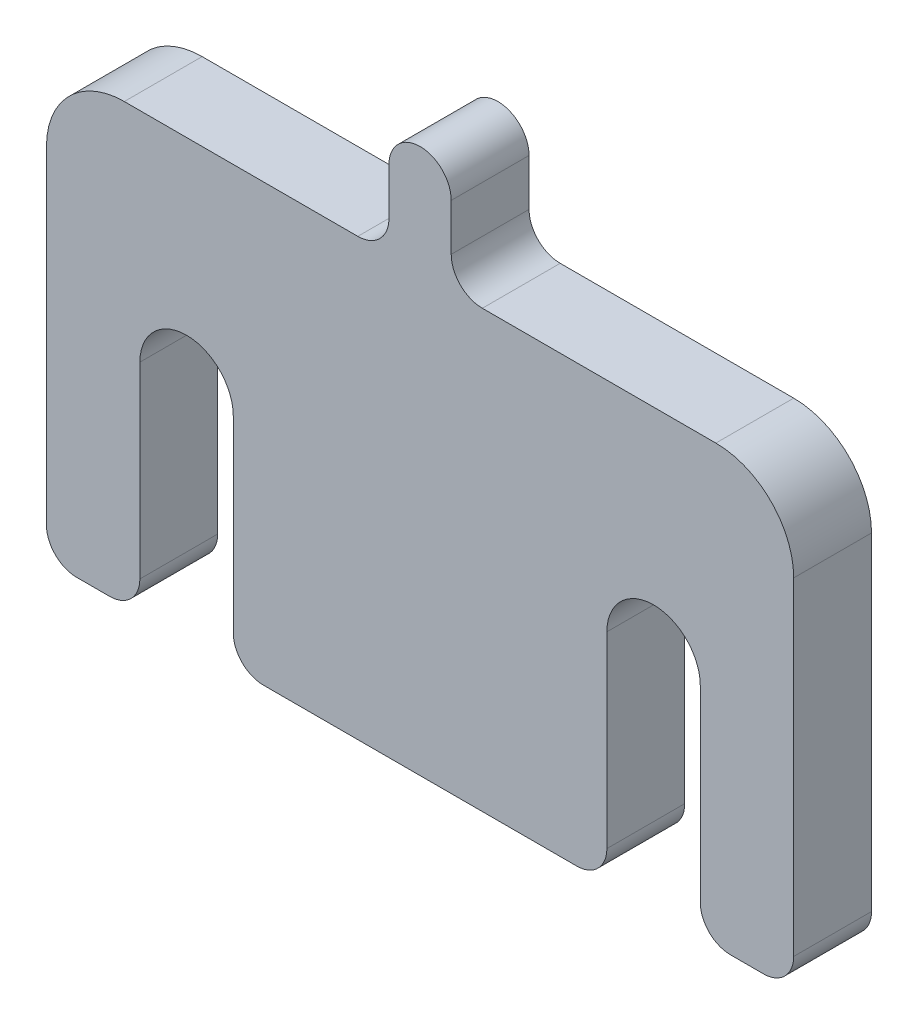
ISO-10303-21;
HEADER;
FILE_DESCRIPTION(('STEP AP214'),'2;1');
FILE_NAME('part.step','',(''),(''),'','','');
FILE_SCHEMA(('AUTOMOTIVE_DESIGN { 1 0 10303 214 1 1 1 1 }'));
ENDSEC;
DATA;
#1=APPLICATION_CONTEXT('core data for automotive mechanical design processes');
#2=APPLICATION_PROTOCOL_DEFINITION('international standard','automotive_design',2000,#1);
#3=PRODUCT_CONTEXT('',#1,'mechanical');
#4=PRODUCT('Part','Part','',(#3));
#5=PRODUCT_RELATED_PRODUCT_CATEGORY('part','',(#4));
#6=PRODUCT_DEFINITION_FORMATION('','',#4);
#7=PRODUCT_DEFINITION_CONTEXT('part definition',#1,'design');
#8=PRODUCT_DEFINITION('design','',#6,#7);
#9=PRODUCT_DEFINITION_SHAPE('','',#8);
#10=(LENGTH_UNIT() NAMED_UNIT(*) SI_UNIT(.MILLI.,.METRE.));
#11=(NAMED_UNIT(*) PLANE_ANGLE_UNIT() SI_UNIT($,.RADIAN.));
#12=(NAMED_UNIT(*) SI_UNIT($,.STERADIAN.) SOLID_ANGLE_UNIT());
#13=UNCERTAINTY_MEASURE_WITH_UNIT(LENGTH_MEASURE(1.E-05),#10,'distance_accuracy_value','');
#14=(GEOMETRIC_REPRESENTATION_CONTEXT(3) GLOBAL_UNCERTAINTY_ASSIGNED_CONTEXT((#13)) GLOBAL_UNIT_ASSIGNED_CONTEXT((#10,
#11,#12)) REPRESENTATION_CONTEXT('',''));
#15=CARTESIAN_POINT('',(0.,0.,0.));
#16=DIRECTION('',(0.,0.,1.));
#17=DIRECTION('',(1.,0.,0.));
#18=AXIS2_PLACEMENT_3D('',#15,#16,#17);
#19=CARTESIAN_POINT('',(0.,14.,-5.));
#20=DIRECTION('',(0.,-1.,0.));
#21=DIRECTION('',(1.,0.,0.));
#22=AXIS2_PLACEMENT_3D('',#19,#20,#21);
#23=PLANE('',#22);
#24=DIRECTION('',(-1.,0.,0.));
#25=VECTOR('',#24,1.);
#26=CARTESIAN_POINT('',(0.,14.,0.));
#27=LINE('',#26,#25);
#28=CARTESIAN_POINT('',(19.,14.,0.));
#29=VERTEX_POINT('',#28);
#30=CARTESIAN_POINT('',(4.,14.,0.));
#31=VERTEX_POINT('',#30);
#32=EDGE_CURVE('E243',#29,#31,#27,.T.);
#33=ORIENTED_EDGE('',*,*,#32,.F.);
#34=DIRECTION('',(0.,0.,1.));
#35=VECTOR('',#34,1.);
#36=CARTESIAN_POINT('',(19.,14.,-5.));
#37=LINE('',#36,#35);
#38=CARTESIAN_POINT('',(19.,14.,-5.));
#39=VERTEX_POINT('',#38);
#40=EDGE_CURVE('E242',#39,#29,#37,.T.);
#41=ORIENTED_EDGE('',*,*,#40,.F.);
#42=DIRECTION('',(-1.,0.,0.));
#43=VECTOR('',#42,1.);
#44=CARTESIAN_POINT('',(0.,14.,-5.));
#45=LINE('',#44,#43);
#46=CARTESIAN_POINT('',(4.,14.,-5.));
#47=VERTEX_POINT('',#46);
#48=EDGE_CURVE('E304',#39,#47,#45,.T.);
#49=ORIENTED_EDGE('',*,*,#48,.T.);
#50=DIRECTION('',(0.,0.,1.));
#51=VECTOR('',#50,1.);
#52=CARTESIAN_POINT('',(4.,14.,-5.));
#53=LINE('',#52,#51);
#54=EDGE_CURVE('E11',#47,#31,#53,.T.);
#55=ORIENTED_EDGE('',*,*,#54,.T.);
#56=EDGE_LOOP('',(#33,#41,#49,#55));
#57=FACE_BOUND('',#56,.T.);
#58=ADVANCED_FACE('F39',(#57),#23,.F.);
#59=CARTESIAN_POINT('',(4.,16.,-5.));
#60=DIRECTION('',(0.,0.,1.));
#61=DIRECTION('',(-1.,0.,0.));
#62=AXIS2_PLACEMENT_3D('',#59,#60,#61);
#63=CYLINDRICAL_SURFACE('',#62,2.);
#64=CARTESIAN_POINT('',(4.,16.,0.));
#65=DIRECTION('',(0.,0.,1.));
#66=DIRECTION('',(1.,0.,0.));
#67=AXIS2_PLACEMENT_3D('',#64,#65,#66);
#68=CIRCLE('',#67,2.);
#69=CARTESIAN_POINT('',(2.,16.,0.));
#70=VERTEX_POINT('',#69);
#71=EDGE_CURVE('E245',#31,#70,#68,.F.);
#72=ORIENTED_EDGE('',*,*,#71,.F.);
#73=ORIENTED_EDGE('',*,*,#54,.F.);
#74=CARTESIAN_POINT('',(4.,16.,-5.));
#75=DIRECTION('',(0.,0.,1.));
#76=DIRECTION('',(1.,0.,0.));
#77=AXIS2_PLACEMENT_3D('',#74,#75,#76);
#78=CIRCLE('',#77,2.);
#79=CARTESIAN_POINT('',(2.,16.,-5.));
#80=VERTEX_POINT('',#79);
#81=EDGE_CURVE('E147',#47,#80,#78,.F.);
#82=ORIENTED_EDGE('',*,*,#81,.T.);
#83=DIRECTION('',(0.,0.,1.));
#84=VECTOR('',#83,1.);
#85=CARTESIAN_POINT('',(2.,16.,-5.));
#86=LINE('',#85,#84);
#87=EDGE_CURVE('E47',#80,#70,#86,.T.);
#88=ORIENTED_EDGE('',*,*,#87,.T.);
#89=EDGE_LOOP('',(#72,#73,#82,#88));
#90=FACE_BOUND('',#89,.T.);
#91=ADVANCED_FACE('F370',(#90),#63,.F.);
#92=CARTESIAN_POINT('',(1.99999999999999,0.,-5.));
#93=DIRECTION('',(1.,0.,0.));
#94=DIRECTION('',(0.,1.,0.));
#95=AXIS2_PLACEMENT_3D('',#92,#93,#94);
#96=PLANE('',#95);
#97=DIRECTION('',(0.,-1.,0.));
#98=VECTOR('',#97,1.);
#99=CARTESIAN_POINT('',(1.99999999999999,0.,0.));
#100=LINE('',#99,#98);
#101=CARTESIAN_POINT('',(2.,19.,0.));
#102=VERTEX_POINT('',#101);
#103=EDGE_CURVE('E248',#102,#70,#100,.T.);
#104=ORIENTED_EDGE('',*,*,#103,.T.);
#105=ORIENTED_EDGE('',*,*,#87,.F.);
#106=DIRECTION('',(0.,-1.,0.));
#107=VECTOR('',#106,1.);
#108=CARTESIAN_POINT('',(1.99999999999999,0.,-5.));
#109=LINE('',#108,#107);
#110=CARTESIAN_POINT('',(2.,19.,-5.));
#111=VERTEX_POINT('',#110);
#112=EDGE_CURVE('E380',#111,#80,#109,.T.);
#113=ORIENTED_EDGE('',*,*,#112,.F.);
#114=DIRECTION('',(0.,0.,1.));
#115=VECTOR('',#114,1.);
#116=CARTESIAN_POINT('',(2.,19.,-5.));
#117=LINE('',#116,#115);
#118=EDGE_CURVE('E365',#111,#102,#117,.T.);
#119=ORIENTED_EDGE('',*,*,#118,.T.);
#120=EDGE_LOOP('',(#104,#105,#113,#119));
#121=FACE_BOUND('',#120,.T.);
#122=ADVANCED_FACE('F508',(#121),#96,.T.);
#123=CARTESIAN_POINT('',(0.,19.,-5.));
#124=DIRECTION('',(0.,0.,1.));
#125=DIRECTION('',(-1.,0.,0.));
#126=AXIS2_PLACEMENT_3D('',#123,#124,#125);
#127=CYLINDRICAL_SURFACE('',#126,2.);
#128=CARTESIAN_POINT('',(0.,19.,0.));
#129=DIRECTION('',(0.,0.,1.));
#130=DIRECTION('',(1.,0.,0.));
#131=AXIS2_PLACEMENT_3D('',#128,#129,#130);
#132=CIRCLE('',#131,2.);
#133=CARTESIAN_POINT('',(-2.,19.,0.));
#134=VERTEX_POINT('',#133);
#135=EDGE_CURVE('E250',#102,#134,#132,.T.);
#136=ORIENTED_EDGE('',*,*,#135,.F.);
#137=ORIENTED_EDGE('',*,*,#118,.F.);
#138=CARTESIAN_POINT('',(0.,19.,-5.));
#139=DIRECTION('',(0.,0.,1.));
#140=DIRECTION('',(1.,0.,0.));
#141=AXIS2_PLACEMENT_3D('',#138,#139,#140);
#142=CIRCLE('',#141,2.);
#143=CARTESIAN_POINT('',(-2.,19.,-5.));
#144=VERTEX_POINT('',#143);
#145=EDGE_CURVE('E384',#111,#144,#142,.T.);
#146=ORIENTED_EDGE('',*,*,#145,.T.);
#147=DIRECTION('',(0.,0.,1.));
#148=VECTOR('',#147,1.);
#149=CARTESIAN_POINT('',(-2.,19.,-5.));
#150=LINE('',#149,#148);
#151=EDGE_CURVE('E362',#144,#134,#150,.T.);
#152=ORIENTED_EDGE('',*,*,#151,.T.);
#153=EDGE_LOOP('',(#136,#137,#146,#152));
#154=FACE_BOUND('',#153,.T.);
#155=ADVANCED_FACE('F507',(#154),#127,.T.);
#156=CARTESIAN_POINT('',(-1.99999999999999,0.,-5.));
#157=DIRECTION('',(1.,0.,0.));
#158=DIRECTION('',(0.,1.,0.));
#159=AXIS2_PLACEMENT_3D('',#156,#157,#158);
#160=PLANE('',#159);
#161=DIRECTION('',(0.,-1.,0.));
#162=VECTOR('',#161,1.);
#163=CARTESIAN_POINT('',(-1.99999999999999,0.,0.));
#164=LINE('',#163,#162);
#165=CARTESIAN_POINT('',(-2.,16.,0.));
#166=VERTEX_POINT('',#165);
#167=EDGE_CURVE('E253',#134,#166,#164,.T.);
#168=ORIENTED_EDGE('',*,*,#167,.F.);
#169=ORIENTED_EDGE('',*,*,#151,.F.);
#170=DIRECTION('',(0.,-1.,0.));
#171=VECTOR('',#170,1.);
#172=CARTESIAN_POINT('',(-1.99999999999999,0.,-5.));
#173=LINE('',#172,#171);
#174=CARTESIAN_POINT('',(-2.,16.,-5.));
#175=VERTEX_POINT('',#174);
#176=EDGE_CURVE('E387',#144,#175,#173,.T.);
#177=ORIENTED_EDGE('',*,*,#176,.T.);
#178=DIRECTION('',(0.,0.,1.));
#179=VECTOR('',#178,1.);
#180=CARTESIAN_POINT('',(-2.,16.,-5.));
#181=LINE('',#180,#179);
#182=EDGE_CURVE('E359',#175,#166,#181,.T.);
#183=ORIENTED_EDGE('',*,*,#182,.T.);
#184=EDGE_LOOP('',(#168,#169,#177,#183));
#185=FACE_BOUND('',#184,.T.);
#186=ADVANCED_FACE('F504',(#185),#160,.F.);
#187=CARTESIAN_POINT('',(-4.,16.,-5.));
#188=DIRECTION('',(0.,0.,1.));
#189=DIRECTION('',(-1.,0.,0.));
#190=AXIS2_PLACEMENT_3D('',#187,#188,#189);
#191=CYLINDRICAL_SURFACE('',#190,2.);
#192=CARTESIAN_POINT('',(-4.,16.,0.));
#193=DIRECTION('',(0.,0.,1.));
#194=DIRECTION('',(1.,0.,0.));
#195=AXIS2_PLACEMENT_3D('',#192,#193,#194);
#196=CIRCLE('',#195,2.);
#197=CARTESIAN_POINT('',(-4.,14.,0.));
#198=VERTEX_POINT('',#197);
#199=EDGE_CURVE('E256',#198,#166,#196,.T.);
#200=ORIENTED_EDGE('',*,*,#199,.T.);
#201=ORIENTED_EDGE('',*,*,#182,.F.);
#202=CARTESIAN_POINT('',(-4.,16.,-5.));
#203=DIRECTION('',(0.,0.,1.));
#204=DIRECTION('',(1.,0.,0.));
#205=AXIS2_PLACEMENT_3D('',#202,#203,#204);
#206=CIRCLE('',#205,2.);
#207=CARTESIAN_POINT('',(-4.,14.,-5.));
#208=VERTEX_POINT('',#207);
#209=EDGE_CURVE('E390',#208,#175,#206,.T.);
#210=ORIENTED_EDGE('',*,*,#209,.F.);
#211=DIRECTION('',(0.,0.,1.));
#212=VECTOR('',#211,1.);
#213=CARTESIAN_POINT('',(-4.,14.,-5.));
#214=LINE('',#213,#212);
#215=EDGE_CURVE('E356',#208,#198,#214,.T.);
#216=ORIENTED_EDGE('',*,*,#215,.T.);
#217=EDGE_LOOP('',(#200,#201,#210,#216));
#218=FACE_BOUND('',#217,.T.);
#219=ADVANCED_FACE('F501',(#218),#191,.F.);
#220=CARTESIAN_POINT('',(0.,14.,-5.));
#221=DIRECTION('',(0.,-1.,0.));
#222=DIRECTION('',(1.,0.,0.));
#223=AXIS2_PLACEMENT_3D('',#220,#221,#222);
#224=PLANE('',#223);
#225=DIRECTION('',(-1.,0.,0.));
#226=VECTOR('',#225,1.);
#227=CARTESIAN_POINT('',(0.,14.,0.));
#228=LINE('',#227,#226);
#229=CARTESIAN_POINT('',(-19.,14.,0.));
#230=VERTEX_POINT('',#229);
#231=EDGE_CURVE('E258',#198,#230,#228,.T.);
#232=ORIENTED_EDGE('',*,*,#231,.F.);
#233=ORIENTED_EDGE('',*,*,#215,.F.);
#234=DIRECTION('',(-1.,0.,0.));
#235=VECTOR('',#234,1.);
#236=CARTESIAN_POINT('',(0.,14.,-5.));
#237=LINE('',#236,#235);
#238=CARTESIAN_POINT('',(-19.,14.,-5.));
#239=VERTEX_POINT('',#238);
#240=EDGE_CURVE('E392',#208,#239,#237,.T.);
#241=ORIENTED_EDGE('',*,*,#240,.T.);
#242=DIRECTION('',(0.,0.,1.));
#243=VECTOR('',#242,1.);
#244=CARTESIAN_POINT('',(-19.,14.,-5.));
#245=LINE('',#244,#243);
#246=EDGE_CURVE('E353',#239,#230,#245,.T.);
#247=ORIENTED_EDGE('',*,*,#246,.T.);
#248=EDGE_LOOP('',(#232,#233,#241,#247));
#249=FACE_BOUND('',#248,.T.);
#250=ADVANCED_FACE('F498',(#249),#224,.F.);
#251=CARTESIAN_POINT('',(-19.,9.,-5.));
#252=DIRECTION('',(0.,0.,1.));
#253=DIRECTION('',(-1.,0.,0.));
#254=AXIS2_PLACEMENT_3D('',#251,#252,#253);
#255=CYLINDRICAL_SURFACE('',#254,5.);
#256=CARTESIAN_POINT('',(-19.,9.,0.));
#257=DIRECTION('',(0.,0.,1.));
#258=DIRECTION('',(1.,0.,0.));
#259=AXIS2_PLACEMENT_3D('',#256,#257,#258);
#260=CIRCLE('',#259,5.);
#261=CARTESIAN_POINT('',(-24.,9.,0.));
#262=VERTEX_POINT('',#261);
#263=EDGE_CURVE('E261',#262,#230,#260,.F.);
#264=ORIENTED_EDGE('',*,*,#263,.T.);
#265=ORIENTED_EDGE('',*,*,#246,.F.);
#266=CARTESIAN_POINT('',(-19.,9.,-5.));
#267=DIRECTION('',(0.,0.,1.));
#268=DIRECTION('',(1.,0.,0.));
#269=AXIS2_PLACEMENT_3D('',#266,#267,#268);
#270=CIRCLE('',#269,5.);
#271=CARTESIAN_POINT('',(-24.,9.,-5.));
#272=VERTEX_POINT('',#271);
#273=EDGE_CURVE('E395',#272,#239,#270,.F.);
#274=ORIENTED_EDGE('',*,*,#273,.F.);
#275=DIRECTION('',(0.,0.,1.));
#276=VECTOR('',#275,1.);
#277=CARTESIAN_POINT('',(-24.,9.,-5.));
#278=LINE('',#277,#276);
#279=EDGE_CURVE('E350',#272,#262,#278,.T.);
#280=ORIENTED_EDGE('',*,*,#279,.T.);
#281=EDGE_LOOP('',(#264,#265,#274,#280));
#282=FACE_BOUND('',#281,.T.);
#283=ADVANCED_FACE('F493',(#282),#255,.T.);
#284=CARTESIAN_POINT('',(-24.,0.,-5.));
#285=DIRECTION('',(-1.,0.,0.));
#286=DIRECTION('',(0.,0.,-1.));
#287=AXIS2_PLACEMENT_3D('',#284,#285,#286);
#288=PLANE('',#287);
#289=DIRECTION('',(0.,1.,0.));
#290=VECTOR('',#289,1.);
#291=CARTESIAN_POINT('',(-24.,0.,0.));
#292=LINE('',#291,#290);
#293=CARTESIAN_POINT('',(-24.,-12.0597401295921,0.));
#294=VERTEX_POINT('',#293);
#295=EDGE_CURVE('E263',#294,#262,#292,.T.);
#296=ORIENTED_EDGE('',*,*,#295,.T.);
#297=ORIENTED_EDGE('',*,*,#279,.F.);
#298=DIRECTION('',(0.,1.,0.));
#299=VECTOR('',#298,1.);
#300=CARTESIAN_POINT('',(-24.,0.,-5.));
#301=LINE('',#300,#299);
#302=CARTESIAN_POINT('',(-24.,-12.0597401295921,-5.));
#303=VERTEX_POINT('',#302);
#304=EDGE_CURVE('E397',#303,#272,#301,.T.);
#305=ORIENTED_EDGE('',*,*,#304,.F.);
#306=DIRECTION('',(0.,0.,1.));
#307=VECTOR('',#306,1.);
#308=CARTESIAN_POINT('',(-24.,-12.0597401295921,-5.));
#309=LINE('',#308,#307);
#310=EDGE_CURVE('E347',#303,#294,#309,.T.);
#311=ORIENTED_EDGE('',*,*,#310,.T.);
#312=EDGE_LOOP('',(#296,#297,#305,#311));
#313=FACE_BOUND('',#312,.T.);
#314=ADVANCED_FACE('F488',(#313),#288,.T.);
#315=CARTESIAN_POINT('',(-22.0597401295921,-12.0597401295921,-5.));
#316=DIRECTION('',(0.,0.,1.));
#317=DIRECTION('',(-1.,0.,0.));
#318=AXIS2_PLACEMENT_3D('',#315,#316,#317);
#319=CYLINDRICAL_SURFACE('',#318,1.94025987040791);
#320=CARTESIAN_POINT('',(-22.0597401295921,-12.0597401295921,0.));
#321=DIRECTION('',(0.,0.,1.));
#322=DIRECTION('',(1.,0.,0.));
#323=AXIS2_PLACEMENT_3D('',#320,#321,#322);
#324=CIRCLE('',#323,1.94025987040791);
#325=CARTESIAN_POINT('',(-22.0597401295921,-14.,0.));
#326=VERTEX_POINT('',#325);
#327=EDGE_CURVE('E265',#294,#326,#324,.T.);
#328=ORIENTED_EDGE('',*,*,#327,.F.);
#329=ORIENTED_EDGE('',*,*,#310,.F.);
#330=CARTESIAN_POINT('',(-22.0597401295921,-12.0597401295921,-5.));
#331=DIRECTION('',(0.,0.,1.));
#332=DIRECTION('',(1.,0.,0.));
#333=AXIS2_PLACEMENT_3D('',#330,#331,#332);
#334=CIRCLE('',#333,1.94025987040791);
#335=CARTESIAN_POINT('',(-22.0597401295921,-14.,-5.));
#336=VERTEX_POINT('',#335);
#337=EDGE_CURVE('E399',#303,#336,#334,.T.);
#338=ORIENTED_EDGE('',*,*,#337,.T.);
#339=DIRECTION('',(0.,0.,1.));
#340=VECTOR('',#339,1.);
#341=CARTESIAN_POINT('',(-22.0597401295921,-14.,-5.));
#342=LINE('',#341,#340);
#343=EDGE_CURVE('E344',#336,#326,#342,.T.);
#344=ORIENTED_EDGE('',*,*,#343,.T.);
#345=EDGE_LOOP('',(#328,#329,#338,#344));
#346=FACE_BOUND('',#345,.T.);
#347=ADVANCED_FACE('F485',(#346),#319,.T.);
#348=CARTESIAN_POINT('',(0.,-14.,-5.));
#349=DIRECTION('',(0.,-1.,0.));
#350=DIRECTION('',(0.,0.,1.));
#351=AXIS2_PLACEMENT_3D('',#348,#349,#350);
#352=PLANE('',#351);
#353=DIRECTION('',(-1.,0.,0.));
#354=VECTOR('',#353,1.);
#355=CARTESIAN_POINT('',(0.,-14.,0.));
#356=LINE('',#355,#354);
#357=CARTESIAN_POINT('',(-19.9402598704079,-14.,0.));
#358=VERTEX_POINT('',#357);
#359=EDGE_CURVE('E268',#358,#326,#356,.T.);
#360=ORIENTED_EDGE('',*,*,#359,.T.);
#361=ORIENTED_EDGE('',*,*,#343,.F.);
#362=DIRECTION('',(-1.,0.,0.));
#363=VECTOR('',#362,1.);
#364=CARTESIAN_POINT('',(0.,-14.,-5.));
#365=LINE('',#364,#363);
#366=CARTESIAN_POINT('',(-19.9402598704079,-14.,-5.));
#367=VERTEX_POINT('',#366);
#368=EDGE_CURVE('E402',#367,#336,#365,.T.);
#369=ORIENTED_EDGE('',*,*,#368,.F.);
#370=DIRECTION('',(0.,0.,1.));
#371=VECTOR('',#370,1.);
#372=CARTESIAN_POINT('',(-19.9402598704079,-14.,-5.));
#373=LINE('',#372,#371);
#374=EDGE_CURVE('E341',#367,#358,#373,.T.);
#375=ORIENTED_EDGE('',*,*,#374,.T.);
#376=EDGE_LOOP('',(#360,#361,#369,#375));
#377=FACE_BOUND('',#376,.T.);
#378=ADVANCED_FACE('F480',(#377),#352,.T.);
#379=CARTESIAN_POINT('',(-19.9402598704079,-12.0597401295921,-5.));
#380=DIRECTION('',(0.,0.,1.));
#381=DIRECTION('',(-1.,0.,0.));
#382=AXIS2_PLACEMENT_3D('',#379,#380,#381);
#383=CYLINDRICAL_SURFACE('',#382,1.94025987040791);
#384=CARTESIAN_POINT('',(-19.9402598704079,-12.0597401295921,0.));
#385=DIRECTION('',(0.,0.,1.));
#386=DIRECTION('',(1.,0.,0.));
#387=AXIS2_PLACEMENT_3D('',#384,#385,#386);
#388=CIRCLE('',#387,1.94025987040791);
#389=CARTESIAN_POINT('',(-18.,-12.0597401295921,0.));
#390=VERTEX_POINT('',#389);
#391=EDGE_CURVE('E270',#358,#390,#388,.T.);
#392=ORIENTED_EDGE('',*,*,#391,.F.);
#393=ORIENTED_EDGE('',*,*,#374,.F.);
#394=CARTESIAN_POINT('',(-19.9402598704079,-12.0597401295921,-5.));
#395=DIRECTION('',(0.,0.,1.));
#396=DIRECTION('',(1.,0.,0.));
#397=AXIS2_PLACEMENT_3D('',#394,#395,#396);
#398=CIRCLE('',#397,1.94025987040791);
#399=CARTESIAN_POINT('',(-18.,-12.0597401295921,-5.));
#400=VERTEX_POINT('',#399);
#401=EDGE_CURVE('E404',#367,#400,#398,.T.);
#402=ORIENTED_EDGE('',*,*,#401,.T.);
#403=DIRECTION('',(0.,0.,1.));
#404=VECTOR('',#403,1.);
#405=CARTESIAN_POINT('',(-18.,-12.0597401295921,-5.));
#406=LINE('',#405,#404);
#407=EDGE_CURVE('E338',#400,#390,#406,.T.);
#408=ORIENTED_EDGE('',*,*,#407,.T.);
#409=EDGE_LOOP('',(#392,#393,#402,#408));
#410=FACE_BOUND('',#409,.T.);
#411=ADVANCED_FACE('F475',(#410),#383,.T.);
#412=CARTESIAN_POINT('',(-18.,0.,-5.));
#413=DIRECTION('',(1.,0.,0.));
#414=DIRECTION('',(0.,1.,0.));
#415=AXIS2_PLACEMENT_3D('',#412,#413,#414);
#416=PLANE('',#415);
#417=DIRECTION('',(0.,-1.,0.));
#418=VECTOR('',#417,1.);
#419=CARTESIAN_POINT('',(-18.,0.,0.));
#420=LINE('',#419,#418);
#421=CARTESIAN_POINT('',(-18.,0.,0.));
#422=VERTEX_POINT('',#421);
#423=EDGE_CURVE('E273',#422,#390,#420,.T.);
#424=ORIENTED_EDGE('',*,*,#423,.T.);
#425=ORIENTED_EDGE('',*,*,#407,.F.);
#426=DIRECTION('',(0.,-1.,0.));
#427=VECTOR('',#426,1.);
#428=CARTESIAN_POINT('',(-18.,0.,-5.));
#429=LINE('',#428,#427);
#430=CARTESIAN_POINT('',(-18.,0.,-5.));
#431=VERTEX_POINT('',#430);
#432=EDGE_CURVE('E407',#431,#400,#429,.T.);
#433=ORIENTED_EDGE('',*,*,#432,.F.);
#434=DIRECTION('',(0.,0.,1.));
#435=VECTOR('',#434,1.);
#436=CARTESIAN_POINT('',(-18.,0.,-5.));
#437=LINE('',#436,#435);
#438=EDGE_CURVE('E335',#431,#422,#437,.T.);
#439=ORIENTED_EDGE('',*,*,#438,.T.);
#440=EDGE_LOOP('',(#424,#425,#433,#439));
#441=FACE_BOUND('',#440,.T.);
#442=ADVANCED_FACE('F472',(#441),#416,.T.);
#443=CARTESIAN_POINT('',(-15.,0.,-5.));
#444=DIRECTION('',(0.,0.,1.));
#445=DIRECTION('',(-1.,0.,0.));
#446=AXIS2_PLACEMENT_3D('',#443,#444,#445);
#447=CYLINDRICAL_SURFACE('',#446,3.);
#448=CARTESIAN_POINT('',(-15.,0.,0.));
#449=DIRECTION('',(0.,0.,1.));
#450=DIRECTION('',(1.,0.,0.));
#451=AXIS2_PLACEMENT_3D('',#448,#449,#450);
#452=CIRCLE('',#451,3.);
#453=CARTESIAN_POINT('',(-12.,0.,0.));
#454=VERTEX_POINT('',#453);
#455=EDGE_CURVE('E275',#454,#422,#452,.T.);
#456=ORIENTED_EDGE('',*,*,#455,.T.);
#457=ORIENTED_EDGE('',*,*,#438,.F.);
#458=CARTESIAN_POINT('',(-15.,0.,-5.));
#459=DIRECTION('',(0.,0.,1.));
#460=DIRECTION('',(1.,0.,0.));
#461=AXIS2_PLACEMENT_3D('',#458,#459,#460);
#462=CIRCLE('',#461,3.);
#463=CARTESIAN_POINT('',(-12.,0.,-5.));
#464=VERTEX_POINT('',#463);
#465=EDGE_CURVE('E409',#464,#431,#462,.T.);
#466=ORIENTED_EDGE('',*,*,#465,.F.);
#467=DIRECTION('',(0.,0.,1.));
#468=VECTOR('',#467,1.);
#469=CARTESIAN_POINT('',(-12.,0.,-5.));
#470=LINE('',#469,#468);
#471=EDGE_CURVE('E332',#464,#454,#470,.T.);
#472=ORIENTED_EDGE('',*,*,#471,.T.);
#473=EDGE_LOOP('',(#456,#457,#466,#472));
#474=FACE_BOUND('',#473,.T.);
#475=ADVANCED_FACE('F467',(#474),#447,.F.);
#476=CARTESIAN_POINT('',(-12.,0.,-5.));
#477=DIRECTION('',(1.,0.,0.));
#478=DIRECTION('',(0.,0.,1.));
#479=AXIS2_PLACEMENT_3D('',#476,#477,#478);
#480=PLANE('',#479);
#481=DIRECTION('',(0.,-1.,0.));
#482=VECTOR('',#481,1.);
#483=CARTESIAN_POINT('',(-12.,0.,0.));
#484=LINE('',#483,#482);
#485=CARTESIAN_POINT('',(-12.,-12.0597401295921,0.));
#486=VERTEX_POINT('',#485);
#487=EDGE_CURVE('E277',#454,#486,#484,.T.);
#488=ORIENTED_EDGE('',*,*,#487,.F.);
#489=ORIENTED_EDGE('',*,*,#471,.F.);
#490=DIRECTION('',(0.,-1.,0.));
#491=VECTOR('',#490,1.);
#492=CARTESIAN_POINT('',(-12.,0.,-5.));
#493=LINE('',#492,#491);
#494=CARTESIAN_POINT('',(-12.,-12.0597401295921,-5.));
#495=VERTEX_POINT('',#494);
#496=EDGE_CURVE('E411',#464,#495,#493,.T.);
#497=ORIENTED_EDGE('',*,*,#496,.T.);
#498=DIRECTION('',(0.,0.,1.));
#499=VECTOR('',#498,1.);
#500=CARTESIAN_POINT('',(-12.,-12.0597401295921,-5.));
#501=LINE('',#500,#499);
#502=EDGE_CURVE('E329',#495,#486,#501,.T.);
#503=ORIENTED_EDGE('',*,*,#502,.T.);
#504=EDGE_LOOP('',(#488,#489,#497,#503));
#505=FACE_BOUND('',#504,.T.);
#506=ADVANCED_FACE('F462',(#505),#480,.F.);
#507=CARTESIAN_POINT('',(-10.0597401295921,-12.0597401295921,-5.));
#508=DIRECTION('',(0.,0.,1.));
#509=DIRECTION('',(-1.,0.,0.));
#510=AXIS2_PLACEMENT_3D('',#507,#508,#509);
#511=CYLINDRICAL_SURFACE('',#510,1.94025987040791);
#512=CARTESIAN_POINT('',(-10.0597401295921,-12.0597401295921,0.));
#513=DIRECTION('',(0.,0.,1.));
#514=DIRECTION('',(1.,0.,0.));
#515=AXIS2_PLACEMENT_3D('',#512,#513,#514);
#516=CIRCLE('',#515,1.94025987040791);
#517=CARTESIAN_POINT('',(-10.0597401295921,-14.,0.));
#518=VERTEX_POINT('',#517);
#519=EDGE_CURVE('E280',#486,#518,#516,.T.);
#520=ORIENTED_EDGE('',*,*,#519,.F.);
#521=ORIENTED_EDGE('',*,*,#502,.F.);
#522=CARTESIAN_POINT('',(-10.0597401295921,-12.0597401295921,-5.));
#523=DIRECTION('',(0.,0.,1.));
#524=DIRECTION('',(1.,0.,0.));
#525=AXIS2_PLACEMENT_3D('',#522,#523,#524);
#526=CIRCLE('',#525,1.94025987040791);
#527=CARTESIAN_POINT('',(-10.0597401295921,-14.,-5.));
#528=VERTEX_POINT('',#527);
#529=EDGE_CURVE('E414',#495,#528,#526,.T.);
#530=ORIENTED_EDGE('',*,*,#529,.T.);
#531=DIRECTION('',(0.,0.,1.));
#532=VECTOR('',#531,1.);
#533=CARTESIAN_POINT('',(-10.0597401295921,-14.,-5.));
#534=LINE('',#533,#532);
#535=EDGE_CURVE('E326',#528,#518,#534,.T.);
#536=ORIENTED_EDGE('',*,*,#535,.T.);
#537=EDGE_LOOP('',(#520,#521,#530,#536));
#538=FACE_BOUND('',#537,.T.);
#539=ADVANCED_FACE('F460',(#538),#511,.T.);
#540=CARTESIAN_POINT('',(0.,-14.,-5.));
#541=DIRECTION('',(0.,-1.,0.));
#542=DIRECTION('',(1.,0.,0.));
#543=AXIS2_PLACEMENT_3D('',#540,#541,#542);
#544=PLANE('',#543);
#545=DIRECTION('',(-1.,0.,0.));
#546=VECTOR('',#545,1.);
#547=CARTESIAN_POINT('',(0.,-14.,0.));
#548=LINE('',#547,#546);
#549=CARTESIAN_POINT('',(10.0597401295921,-14.,0.));
#550=VERTEX_POINT('',#549);
#551=EDGE_CURVE('E283',#550,#518,#548,.T.);
#552=ORIENTED_EDGE('',*,*,#551,.T.);
#553=ORIENTED_EDGE('',*,*,#535,.F.);
#554=DIRECTION('',(-1.,0.,0.));
#555=VECTOR('',#554,1.);
#556=CARTESIAN_POINT('',(0.,-14.,-5.));
#557=LINE('',#556,#555);
#558=CARTESIAN_POINT('',(10.0597401295921,-14.,-5.));
#559=VERTEX_POINT('',#558);
#560=EDGE_CURVE('E417',#559,#528,#557,.T.);
#561=ORIENTED_EDGE('',*,*,#560,.F.);
#562=DIRECTION('',(0.,0.,1.));
#563=VECTOR('',#562,1.);
#564=CARTESIAN_POINT('',(10.0597401295921,-14.,-5.));
#565=LINE('',#564,#563);
#566=EDGE_CURVE('E323',#559,#550,#565,.T.);
#567=ORIENTED_EDGE('',*,*,#566,.T.);
#568=EDGE_LOOP('',(#552,#553,#561,#567));
#569=FACE_BOUND('',#568,.T.);
#570=ADVANCED_FACE('F456',(#569),#544,.T.);
#571=CARTESIAN_POINT('',(10.0597401295921,-12.0597401295921,-5.));
#572=DIRECTION('',(0.,0.,1.));
#573=DIRECTION('',(-1.,0.,0.));
#574=AXIS2_PLACEMENT_3D('',#571,#572,#573);
#575=CYLINDRICAL_SURFACE('',#574,1.94025987040791);
#576=CARTESIAN_POINT('',(10.0597401295921,-12.0597401295921,0.));
#577=DIRECTION('',(0.,0.,1.));
#578=DIRECTION('',(1.,0.,0.));
#579=AXIS2_PLACEMENT_3D('',#576,#577,#578);
#580=CIRCLE('',#579,1.94025987040791);
#581=CARTESIAN_POINT('',(12.,-12.0597401295921,0.));
#582=VERTEX_POINT('',#581);
#583=EDGE_CURVE('E285',#550,#582,#580,.T.);
#584=ORIENTED_EDGE('',*,*,#583,.F.);
#585=ORIENTED_EDGE('',*,*,#566,.F.);
#586=CARTESIAN_POINT('',(10.0597401295921,-12.0597401295921,-5.));
#587=DIRECTION('',(0.,0.,1.));
#588=DIRECTION('',(1.,0.,0.));
#589=AXIS2_PLACEMENT_3D('',#586,#587,#588);
#590=CIRCLE('',#589,1.94025987040791);
#591=CARTESIAN_POINT('',(12.,-12.0597401295921,-5.));
#592=VERTEX_POINT('',#591);
#593=EDGE_CURVE('E419',#559,#592,#590,.T.);
#594=ORIENTED_EDGE('',*,*,#593,.T.);
#595=DIRECTION('',(0.,0.,1.));
#596=VECTOR('',#595,1.);
#597=CARTESIAN_POINT('',(12.,-12.0597401295921,-5.));
#598=LINE('',#597,#596);
#599=EDGE_CURVE('E320',#592,#582,#598,.T.);
#600=ORIENTED_EDGE('',*,*,#599,.T.);
#601=EDGE_LOOP('',(#584,#585,#594,#600));
#602=FACE_BOUND('',#601,.T.);
#603=ADVANCED_FACE('F451',(#602),#575,.T.);
#604=CARTESIAN_POINT('',(12.,0.,-5.));
#605=DIRECTION('',(1.,0.,0.));
#606=DIRECTION('',(0.,1.,0.));
#607=AXIS2_PLACEMENT_3D('',#604,#605,#606);
#608=PLANE('',#607);
#609=DIRECTION('',(0.,-1.,0.));
#610=VECTOR('',#609,1.);
#611=CARTESIAN_POINT('',(12.,0.,0.));
#612=LINE('',#611,#610);
#613=CARTESIAN_POINT('',(12.,0.,0.));
#614=VERTEX_POINT('',#613);
#615=EDGE_CURVE('E288',#614,#582,#612,.T.);
#616=ORIENTED_EDGE('',*,*,#615,.T.);
#617=ORIENTED_EDGE('',*,*,#599,.F.);
#618=DIRECTION('',(0.,-1.,0.));
#619=VECTOR('',#618,1.);
#620=CARTESIAN_POINT('',(12.,0.,-5.));
#621=LINE('',#620,#619);
#622=CARTESIAN_POINT('',(12.,0.,-5.));
#623=VERTEX_POINT('',#622);
#624=EDGE_CURVE('E422',#623,#592,#621,.T.);
#625=ORIENTED_EDGE('',*,*,#624,.F.);
#626=DIRECTION('',(0.,0.,1.));
#627=VECTOR('',#626,1.);
#628=CARTESIAN_POINT('',(12.,0.,-5.));
#629=LINE('',#628,#627);
#630=EDGE_CURVE('E317',#623,#614,#629,.T.);
#631=ORIENTED_EDGE('',*,*,#630,.T.);
#632=EDGE_LOOP('',(#616,#617,#625,#631));
#633=FACE_BOUND('',#632,.T.);
#634=ADVANCED_FACE('F448',(#633),#608,.T.);
#635=CARTESIAN_POINT('',(15.,0.,-5.));
#636=DIRECTION('',(0.,0.,1.));
#637=DIRECTION('',(-1.,0.,0.));
#638=AXIS2_PLACEMENT_3D('',#635,#636,#637);
#639=CYLINDRICAL_SURFACE('',#638,3.);
#640=CARTESIAN_POINT('',(15.,0.,0.));
#641=DIRECTION('',(0.,0.,1.));
#642=DIRECTION('',(1.,0.,0.));
#643=AXIS2_PLACEMENT_3D('',#640,#641,#642);
#644=CIRCLE('',#643,3.);
#645=CARTESIAN_POINT('',(18.,0.,0.));
#646=VERTEX_POINT('',#645);
#647=EDGE_CURVE('E290',#646,#614,#644,.T.);
#648=ORIENTED_EDGE('',*,*,#647,.T.);
#649=ORIENTED_EDGE('',*,*,#630,.F.);
#650=CARTESIAN_POINT('',(15.,0.,-5.));
#651=DIRECTION('',(0.,0.,1.));
#652=DIRECTION('',(1.,0.,0.));
#653=AXIS2_PLACEMENT_3D('',#650,#651,#652);
#654=CIRCLE('',#653,3.);
#655=CARTESIAN_POINT('',(18.,0.,-5.));
#656=VERTEX_POINT('',#655);
#657=EDGE_CURVE('E424',#656,#623,#654,.T.);
#658=ORIENTED_EDGE('',*,*,#657,.F.);
#659=DIRECTION('',(0.,0.,1.));
#660=VECTOR('',#659,1.);
#661=CARTESIAN_POINT('',(18.,0.,-5.));
#662=LINE('',#661,#660);
#663=EDGE_CURVE('E314',#656,#646,#662,.T.);
#664=ORIENTED_EDGE('',*,*,#663,.T.);
#665=EDGE_LOOP('',(#648,#649,#658,#664));
#666=FACE_BOUND('',#665,.T.);
#667=ADVANCED_FACE('F443',(#666),#639,.F.);
#668=CARTESIAN_POINT('',(18.,0.,-5.));
#669=DIRECTION('',(1.,0.,0.));
#670=DIRECTION('',(0.,1.,0.));
#671=AXIS2_PLACEMENT_3D('',#668,#669,#670);
#672=PLANE('',#671);
#673=DIRECTION('',(0.,-1.,0.));
#674=VECTOR('',#673,1.);
#675=CARTESIAN_POINT('',(18.,0.,0.));
#676=LINE('',#675,#674);
#677=CARTESIAN_POINT('',(18.,-12.0597401295921,0.));
#678=VERTEX_POINT('',#677);
#679=EDGE_CURVE('E292',#646,#678,#676,.T.);
#680=ORIENTED_EDGE('',*,*,#679,.F.);
#681=ORIENTED_EDGE('',*,*,#663,.F.);
#682=DIRECTION('',(0.,-1.,0.));
#683=VECTOR('',#682,1.);
#684=CARTESIAN_POINT('',(18.,0.,-5.));
#685=LINE('',#684,#683);
#686=CARTESIAN_POINT('',(18.,-12.0597401295921,-5.));
#687=VERTEX_POINT('',#686);
#688=EDGE_CURVE('E426',#656,#687,#685,.T.);
#689=ORIENTED_EDGE('',*,*,#688,.T.);
#690=DIRECTION('',(0.,0.,1.));
#691=VECTOR('',#690,1.);
#692=CARTESIAN_POINT('',(18.,-12.0597401295921,-5.));
#693=LINE('',#692,#691);
#694=EDGE_CURVE('E311',#687,#678,#693,.T.);
#695=ORIENTED_EDGE('',*,*,#694,.T.);
#696=EDGE_LOOP('',(#680,#681,#689,#695));
#697=FACE_BOUND('',#696,.T.);
#698=ADVANCED_FACE('F439',(#697),#672,.F.);
#699=CARTESIAN_POINT('',(19.9402598704079,-12.0597401295921,-5.));
#700=DIRECTION('',(0.,0.,1.));
#701=DIRECTION('',(-1.,0.,0.));
#702=AXIS2_PLACEMENT_3D('',#699,#700,#701);
#703=CYLINDRICAL_SURFACE('',#702,1.94025987040791);
#704=CARTESIAN_POINT('',(19.9402598704079,-12.0597401295921,0.));
#705=DIRECTION('',(0.,0.,1.));
#706=DIRECTION('',(1.,0.,0.));
#707=AXIS2_PLACEMENT_3D('',#704,#705,#706);
#708=CIRCLE('',#707,1.94025987040791);
#709=CARTESIAN_POINT('',(19.9402598704079,-14.,0.));
#710=VERTEX_POINT('',#709);
#711=EDGE_CURVE('E295',#678,#710,#708,.T.);
#712=ORIENTED_EDGE('',*,*,#711,.F.);
#713=ORIENTED_EDGE('',*,*,#694,.F.);
#714=CARTESIAN_POINT('',(19.9402598704079,-12.0597401295921,-5.));
#715=DIRECTION('',(0.,0.,1.));
#716=DIRECTION('',(1.,0.,0.));
#717=AXIS2_PLACEMENT_3D('',#714,#715,#716);
#718=CIRCLE('',#717,1.94025987040791);
#719=CARTESIAN_POINT('',(19.9402598704079,-14.,-5.));
#720=VERTEX_POINT('',#719);
#721=EDGE_CURVE('E237',#687,#720,#718,.T.);
#722=ORIENTED_EDGE('',*,*,#721,.T.);
#723=DIRECTION('',(0.,0.,1.));
#724=VECTOR('',#723,1.);
#725=CARTESIAN_POINT('',(19.9402598704079,-14.,-5.));
#726=LINE('',#725,#724);
#727=EDGE_CURVE('E308',#720,#710,#726,.T.);
#728=ORIENTED_EDGE('',*,*,#727,.T.);
#729=EDGE_LOOP('',(#712,#713,#722,#728));
#730=FACE_BOUND('',#729,.T.);
#731=ADVANCED_FACE('F431',(#730),#703,.T.);
#732=CARTESIAN_POINT('',(0.,-13.9999999999999,-5.));
#733=DIRECTION('',(0.,-1.,0.));
#734=DIRECTION('',(1.,0.,0.));
#735=AXIS2_PLACEMENT_3D('',#732,#733,#734);
#736=PLANE('',#735);
#737=DIRECTION('',(-1.,0.,0.));
#738=VECTOR('',#737,1.);
#739=CARTESIAN_POINT('',(0.,-13.9999999999999,0.));
#740=LINE('',#739,#738);
#741=CARTESIAN_POINT('',(22.0597401295921,-14.,0.));
#742=VERTEX_POINT('',#741);
#743=EDGE_CURVE('E298',#742,#710,#740,.T.);
#744=ORIENTED_EDGE('',*,*,#743,.T.);
#745=ORIENTED_EDGE('',*,*,#727,.F.);
#746=DIRECTION('',(-1.,0.,0.));
#747=VECTOR('',#746,1.);
#748=CARTESIAN_POINT('',(0.,-13.9999999999999,-5.));
#749=LINE('',#748,#747);
#750=CARTESIAN_POINT('',(22.0597401295921,-14.,-5.));
#751=VERTEX_POINT('',#750);
#752=EDGE_CURVE('E235',#751,#720,#749,.T.);
#753=ORIENTED_EDGE('',*,*,#752,.F.);
#754=DIRECTION('',(0.,0.,1.));
#755=VECTOR('',#754,1.);
#756=CARTESIAN_POINT('',(22.0597401295921,-14.,-5.));
#757=LINE('',#756,#755);
#758=EDGE_CURVE('E229',#751,#742,#757,.T.);
#759=ORIENTED_EDGE('',*,*,#758,.T.);
#760=EDGE_LOOP('',(#744,#745,#753,#759));
#761=FACE_BOUND('',#760,.T.);
#762=ADVANCED_FACE('F435',(#761),#736,.T.);
#763=CARTESIAN_POINT('',(22.0597401295921,-12.0597401295921,-5.));
#764=DIRECTION('',(0.,0.,1.));
#765=DIRECTION('',(-1.,0.,0.));
#766=AXIS2_PLACEMENT_3D('',#763,#764,#765);
#767=CYLINDRICAL_SURFACE('',#766,1.94025987040791);
#768=CARTESIAN_POINT('',(22.0597401295921,-12.0597401295921,0.));
#769=DIRECTION('',(0.,0.,1.));
#770=DIRECTION('',(1.,0.,0.));
#771=AXIS2_PLACEMENT_3D('',#768,#769,#770);
#772=CIRCLE('',#771,1.94025987040791);
#773=CARTESIAN_POINT('',(24.,-12.0597401295921,0.));
#774=VERTEX_POINT('',#773);
#775=EDGE_CURVE('E300',#742,#774,#772,.T.);
#776=ORIENTED_EDGE('',*,*,#775,.F.);
#777=ORIENTED_EDGE('',*,*,#758,.F.);
#778=CARTESIAN_POINT('',(22.0597401295921,-12.0597401295921,-5.));
#779=DIRECTION('',(0.,0.,1.));
#780=DIRECTION('',(1.,0.,0.));
#781=AXIS2_PLACEMENT_3D('',#778,#779,#780);
#782=CIRCLE('',#781,1.94025987040791);
#783=CARTESIAN_POINT('',(24.,-12.0597401295921,-5.));
#784=VERTEX_POINT('',#783);
#785=EDGE_CURVE('E219',#751,#784,#782,.T.);
#786=ORIENTED_EDGE('',*,*,#785,.T.);
#787=DIRECTION('',(0.,0.,1.));
#788=VECTOR('',#787,1.);
#789=CARTESIAN_POINT('',(24.,-12.0597401295921,-5.));
#790=LINE('',#789,#788);
#791=EDGE_CURVE('E224',#784,#774,#790,.T.);
#792=ORIENTED_EDGE('',*,*,#791,.T.);
#793=EDGE_LOOP('',(#776,#777,#786,#792));
#794=FACE_BOUND('',#793,.T.);
#795=ADVANCED_FACE('F232',(#794),#767,.T.);
#796=CARTESIAN_POINT('',(24.,0.,-5.));
#797=DIRECTION('',(-1.,0.,0.));
#798=DIRECTION('',(0.,-1.,0.));
#799=AXIS2_PLACEMENT_3D('',#796,#797,#798);
#800=PLANE('',#799);
#801=DIRECTION('',(0.,1.,0.));
#802=VECTOR('',#801,1.);
#803=CARTESIAN_POINT('',(24.,0.,0.));
#804=LINE('',#803,#802);
#805=CARTESIAN_POINT('',(24.,9.,0.));
#806=VERTEX_POINT('',#805);
#807=EDGE_CURVE('E226',#774,#806,#804,.T.);
#808=ORIENTED_EDGE('',*,*,#807,.F.);
#809=ORIENTED_EDGE('',*,*,#791,.F.);
#810=DIRECTION('',(0.,1.,0.));
#811=VECTOR('',#810,1.);
#812=CARTESIAN_POINT('',(24.,0.,-5.));
#813=LINE('',#812,#811);
#814=CARTESIAN_POINT('',(24.,9.,-5.));
#815=VERTEX_POINT('',#814);
#816=EDGE_CURVE('E215',#784,#815,#813,.T.);
#817=ORIENTED_EDGE('',*,*,#816,.T.);
#818=DIRECTION('',(0.,0.,1.));
#819=VECTOR('',#818,1.);
#820=CARTESIAN_POINT('',(24.,9.,-5.));
#821=LINE('',#820,#819);
#822=EDGE_CURVE('E230',#815,#806,#821,.T.);
#823=ORIENTED_EDGE('',*,*,#822,.T.);
#824=EDGE_LOOP('',(#808,#809,#817,#823));
#825=FACE_BOUND('',#824,.T.);
#826=ADVANCED_FACE('F225',(#825),#800,.F.);
#827=CARTESIAN_POINT('',(19.,9.,-5.));
#828=DIRECTION('',(0.,0.,1.));
#829=DIRECTION('',(-1.,0.,0.));
#830=AXIS2_PLACEMENT_3D('',#827,#828,#829);
#831=CYLINDRICAL_SURFACE('',#830,5.);
#832=CARTESIAN_POINT('',(19.,9.,0.));
#833=DIRECTION('',(0.,0.,1.));
#834=DIRECTION('',(1.,0.,0.));
#835=AXIS2_PLACEMENT_3D('',#832,#833,#834);
#836=CIRCLE('',#835,5.);
#837=EDGE_CURVE('E135',#806,#29,#836,.T.);
#838=ORIENTED_EDGE('',*,*,#837,.F.);
#839=ORIENTED_EDGE('',*,*,#822,.F.);
#840=CARTESIAN_POINT('',(19.,9.,-5.));
#841=DIRECTION('',(0.,0.,1.));
#842=DIRECTION('',(1.,0.,0.));
#843=AXIS2_PLACEMENT_3D('',#840,#841,#842);
#844=CIRCLE('',#843,5.);
#845=EDGE_CURVE('E55',#815,#39,#844,.T.);
#846=ORIENTED_EDGE('',*,*,#845,.T.);
#847=ORIENTED_EDGE('',*,*,#40,.T.);
#848=EDGE_LOOP('',(#838,#839,#846,#847));
#849=FACE_BOUND('',#848,.T.);
#850=ADVANCED_FACE('F682',(#849),#831,.T.);
#851=CARTESIAN_POINT('',(0.,0.,-5.));
#852=DIRECTION('',(0.,0.,-1.));
#853=DIRECTION('',(1.,0.,0.));
#854=AXIS2_PLACEMENT_3D('',#851,#852,#853);
#855=PLANE('',#854);
#856=ORIENTED_EDGE('',*,*,#48,.F.);
#857=ORIENTED_EDGE('',*,*,#845,.F.);
#858=ORIENTED_EDGE('',*,*,#816,.F.);
#859=ORIENTED_EDGE('',*,*,#785,.F.);
#860=ORIENTED_EDGE('',*,*,#752,.T.);
#861=ORIENTED_EDGE('',*,*,#721,.F.);
#862=ORIENTED_EDGE('',*,*,#688,.F.);
#863=ORIENTED_EDGE('',*,*,#657,.T.);
#864=ORIENTED_EDGE('',*,*,#624,.T.);
#865=ORIENTED_EDGE('',*,*,#593,.F.);
#866=ORIENTED_EDGE('',*,*,#560,.T.);
#867=ORIENTED_EDGE('',*,*,#529,.F.);
#868=ORIENTED_EDGE('',*,*,#496,.F.);
#869=ORIENTED_EDGE('',*,*,#465,.T.);
#870=ORIENTED_EDGE('',*,*,#432,.T.);
#871=ORIENTED_EDGE('',*,*,#401,.F.);
#872=ORIENTED_EDGE('',*,*,#368,.T.);
#873=ORIENTED_EDGE('',*,*,#337,.F.);
#874=ORIENTED_EDGE('',*,*,#304,.T.);
#875=ORIENTED_EDGE('',*,*,#273,.T.);
#876=ORIENTED_EDGE('',*,*,#240,.F.);
#877=ORIENTED_EDGE('',*,*,#209,.T.);
#878=ORIENTED_EDGE('',*,*,#176,.F.);
#879=ORIENTED_EDGE('',*,*,#145,.F.);
#880=ORIENTED_EDGE('',*,*,#112,.T.);
#881=ORIENTED_EDGE('',*,*,#81,.F.);
#882=EDGE_LOOP('',(#856,#857,#858,#859,#860,#861,#862,#863,#864,#865,#866,#867,#868,#869,#870,
#871,#872,#873,#874,#875,#876,#877,#878,#879,#880,#881));
#883=FACE_BOUND('',#882,.T.);
#884=ADVANCED_FACE('F217',(#883),#855,.T.);
#885=CARTESIAN_POINT('',(0.,0.,0.));
#886=DIRECTION('',(0.,0.,-1.));
#887=DIRECTION('',(1.,0.,0.));
#888=AXIS2_PLACEMENT_3D('',#885,#886,#887);
#889=PLANE('',#888);
#890=ORIENTED_EDGE('',*,*,#32,.T.);
#891=ORIENTED_EDGE('',*,*,#71,.T.);
#892=ORIENTED_EDGE('',*,*,#103,.F.);
#893=ORIENTED_EDGE('',*,*,#135,.T.);
#894=ORIENTED_EDGE('',*,*,#167,.T.);
#895=ORIENTED_EDGE('',*,*,#199,.F.);
#896=ORIENTED_EDGE('',*,*,#231,.T.);
#897=ORIENTED_EDGE('',*,*,#263,.F.);
#898=ORIENTED_EDGE('',*,*,#295,.F.);
#899=ORIENTED_EDGE('',*,*,#327,.T.);
#900=ORIENTED_EDGE('',*,*,#359,.F.);
#901=ORIENTED_EDGE('',*,*,#391,.T.);
#902=ORIENTED_EDGE('',*,*,#423,.F.);
#903=ORIENTED_EDGE('',*,*,#455,.F.);
#904=ORIENTED_EDGE('',*,*,#487,.T.);
#905=ORIENTED_EDGE('',*,*,#519,.T.);
#906=ORIENTED_EDGE('',*,*,#551,.F.);
#907=ORIENTED_EDGE('',*,*,#583,.T.);
#908=ORIENTED_EDGE('',*,*,#615,.F.);
#909=ORIENTED_EDGE('',*,*,#647,.F.);
#910=ORIENTED_EDGE('',*,*,#679,.T.);
#911=ORIENTED_EDGE('',*,*,#711,.T.);
#912=ORIENTED_EDGE('',*,*,#743,.F.);
#913=ORIENTED_EDGE('',*,*,#775,.T.);
#914=ORIENTED_EDGE('',*,*,#807,.T.);
#915=ORIENTED_EDGE('',*,*,#837,.T.);
#916=EDGE_LOOP('',(#890,#891,#892,#893,#894,#895,#896,#897,#898,#899,#900,#901,#902,#903,#904,
#905,#906,#907,#908,#909,#910,#911,#912,#913,#914,#915));
#917=FACE_BOUND('',#916,.T.);
#918=ADVANCED_FACE('F374',(#917),#889,.F.);
#919=CLOSED_SHELL('',(#58,#91,#122,#155,#186,#219,#250,#283,#314,#347,#378,#411,#442,#475,#506,
#539,#570,#603,#634,#667,#698,#731,#762,#795,#826,#850,#884,#918));
#920=MANIFOLD_SOLID_BREP('B2',#919);
#921=ADVANCED_BREP_SHAPE_REPRESENTATION('',(#18,#920),#14);
#922=SHAPE_DEFINITION_REPRESENTATION(#9,#921);
ENDSEC;
END-ISO-10303-21;
